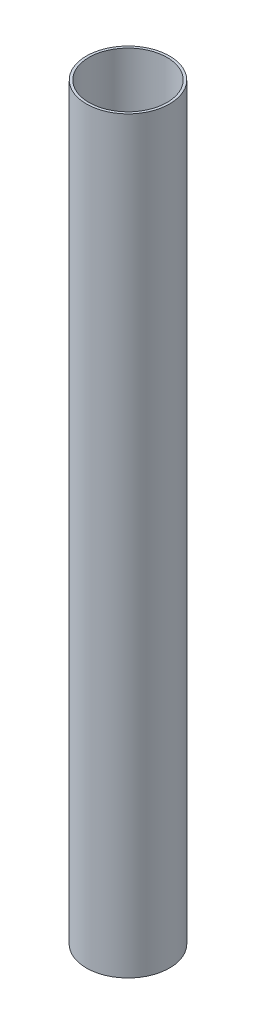
ISO-10303-21;
HEADER;
FILE_DESCRIPTION(('STEP AP214'),'2;1');
FILE_NAME('part.step','',(''),(''),'','','');
FILE_SCHEMA(('AUTOMOTIVE_DESIGN { 1 0 10303 214 1 1 1 1 }'));
ENDSEC;
DATA;
#1=APPLICATION_CONTEXT('core data for automotive mechanical design processes');
#2=APPLICATION_PROTOCOL_DEFINITION('international standard','automotive_design',2000,#1);
#3=PRODUCT_CONTEXT('',#1,'mechanical');
#4=PRODUCT('Part','Part','',(#3));
#5=PRODUCT_RELATED_PRODUCT_CATEGORY('part','',(#4));
#6=PRODUCT_DEFINITION_FORMATION('','',#4);
#7=PRODUCT_DEFINITION_CONTEXT('part definition',#1,'design');
#8=PRODUCT_DEFINITION('design','',#6,#7);
#9=PRODUCT_DEFINITION_SHAPE('','',#8);
#10=(LENGTH_UNIT() NAMED_UNIT(*) SI_UNIT(.MILLI.,.METRE.));
#11=(NAMED_UNIT(*) PLANE_ANGLE_UNIT() SI_UNIT($,.RADIAN.));
#12=(NAMED_UNIT(*) SI_UNIT($,.STERADIAN.) SOLID_ANGLE_UNIT());
#13=UNCERTAINTY_MEASURE_WITH_UNIT(LENGTH_MEASURE(1.E-05),#10,'distance_accuracy_value','');
#14=(GEOMETRIC_REPRESENTATION_CONTEXT(3) GLOBAL_UNCERTAINTY_ASSIGNED_CONTEXT((#13)) GLOBAL_UNIT_ASSIGNED_CONTEXT((#10,
#11,#12)) REPRESENTATION_CONTEXT('',''));
#15=CARTESIAN_POINT('',(0.,0.,0.));
#16=DIRECTION('',(0.,0.,1.));
#17=DIRECTION('',(1.,0.,0.));
#18=AXIS2_PLACEMENT_3D('',#15,#16,#17);
#19=CARTESIAN_POINT('',(0.,114.3,0.));
#20=DIRECTION('',(0.,1.,0.));
#21=DIRECTION('',(0.,0.,1.));
#22=AXIS2_PLACEMENT_3D('',#19,#20,#21);
#23=PLANE('',#22);
#24=CARTESIAN_POINT('',(0.,114.3,0.));
#25=DIRECTION('',(0.,1.,0.));
#26=DIRECTION('',(0.,0.,1.));
#27=AXIS2_PLACEMENT_3D('',#24,#25,#26);
#28=CIRCLE('',#27,6.35);
#29=CARTESIAN_POINT('',(0.,114.3,6.35));
#30=VERTEX_POINT('',#29);
#31=EDGE_CURVE('E10',#30,#30,#28,.T.);
#32=ORIENTED_EDGE('',*,*,#31,.T.);
#33=EDGE_LOOP('',(#32));
#34=FACE_BOUND('',#33,.T.);
#35=CARTESIAN_POINT('',(0.,114.3,0.));
#36=DIRECTION('',(0.,1.,0.));
#37=DIRECTION('',(0.,0.,1.));
#38=AXIS2_PLACEMENT_3D('',#35,#36,#37);
#39=CIRCLE('',#38,5.969);
#40=CARTESIAN_POINT('',(0.,114.3,5.969));
#41=VERTEX_POINT('',#40);
#42=EDGE_CURVE('E43',#41,#41,#39,.T.);
#43=ORIENTED_EDGE('',*,*,#42,.F.);
#44=EDGE_LOOP('',(#43));
#45=FACE_BOUND('',#44,.T.);
#46=ADVANCED_FACE('F32',(#34,#45),#23,.T.);
#47=CARTESIAN_POINT('',(0.,0.,0.));
#48=DIRECTION('',(0.,1.,0.));
#49=DIRECTION('',(0.,0.,1.));
#50=AXIS2_PLACEMENT_3D('',#47,#48,#49);
#51=PLANE('',#50);
#52=CARTESIAN_POINT('',(0.,0.,0.));
#53=DIRECTION('',(0.,1.,0.));
#54=DIRECTION('',(0.,0.,1.));
#55=AXIS2_PLACEMENT_3D('',#52,#53,#54);
#56=CIRCLE('',#55,6.35);
#57=CARTESIAN_POINT('',(0.,0.,6.35));
#58=VERTEX_POINT('',#57);
#59=EDGE_CURVE('E36',#58,#58,#56,.T.);
#60=ORIENTED_EDGE('',*,*,#59,.F.);
#61=EDGE_LOOP('',(#60));
#62=FACE_BOUND('',#61,.T.);
#63=CARTESIAN_POINT('',(0.,0.,0.));
#64=DIRECTION('',(0.,1.,0.));
#65=DIRECTION('',(0.,0.,1.));
#66=AXIS2_PLACEMENT_3D('',#63,#64,#65);
#67=CIRCLE('',#66,5.969);
#68=CARTESIAN_POINT('',(0.,0.,5.969));
#69=VERTEX_POINT('',#68);
#70=EDGE_CURVE('E45',#69,#69,#67,.T.);
#71=ORIENTED_EDGE('',*,*,#70,.T.);
#72=EDGE_LOOP('',(#71));
#73=FACE_BOUND('',#72,.T.);
#74=ADVANCED_FACE('F55',(#62,#73),#51,.F.);
#75=CARTESIAN_POINT('',(0.,114.3,0.));
#76=DIRECTION('',(0.,-1.,0.));
#77=DIRECTION('',(0.,0.,-1.));
#78=AXIS2_PLACEMENT_3D('',#75,#76,#77);
#79=CYLINDRICAL_SURFACE('',#78,6.35);
#80=ORIENTED_EDGE('',*,*,#31,.F.);
#81=EDGE_LOOP('',(#80));
#82=FACE_BOUND('',#81,.T.);
#83=ORIENTED_EDGE('',*,*,#59,.T.);
#84=EDGE_LOOP('',(#83));
#85=FACE_BOUND('',#84,.T.);
#86=ADVANCED_FACE('F34',(#82,#85),#79,.T.);
#87=CARTESIAN_POINT('',(0.,114.3,0.));
#88=DIRECTION('',(0.,-1.,0.));
#89=DIRECTION('',(0.,0.,-1.));
#90=AXIS2_PLACEMENT_3D('',#87,#88,#89);
#91=CYLINDRICAL_SURFACE('',#90,5.969);
#92=ORIENTED_EDGE('',*,*,#42,.T.);
#93=EDGE_LOOP('',(#92));
#94=FACE_BOUND('',#93,.T.);
#95=ORIENTED_EDGE('',*,*,#70,.F.);
#96=EDGE_LOOP('',(#95));
#97=FACE_BOUND('',#96,.T.);
#98=ADVANCED_FACE('F51',(#94,#97),#91,.F.);
#99=CLOSED_SHELL('',(#46,#74,#86,#98));
#100=MANIFOLD_SOLID_BREP('B2',#99);
#101=ADVANCED_BREP_SHAPE_REPRESENTATION('',(#18,#100),#14);
#102=SHAPE_DEFINITION_REPRESENTATION(#9,#101);
ENDSEC;
END-ISO-10303-21;
